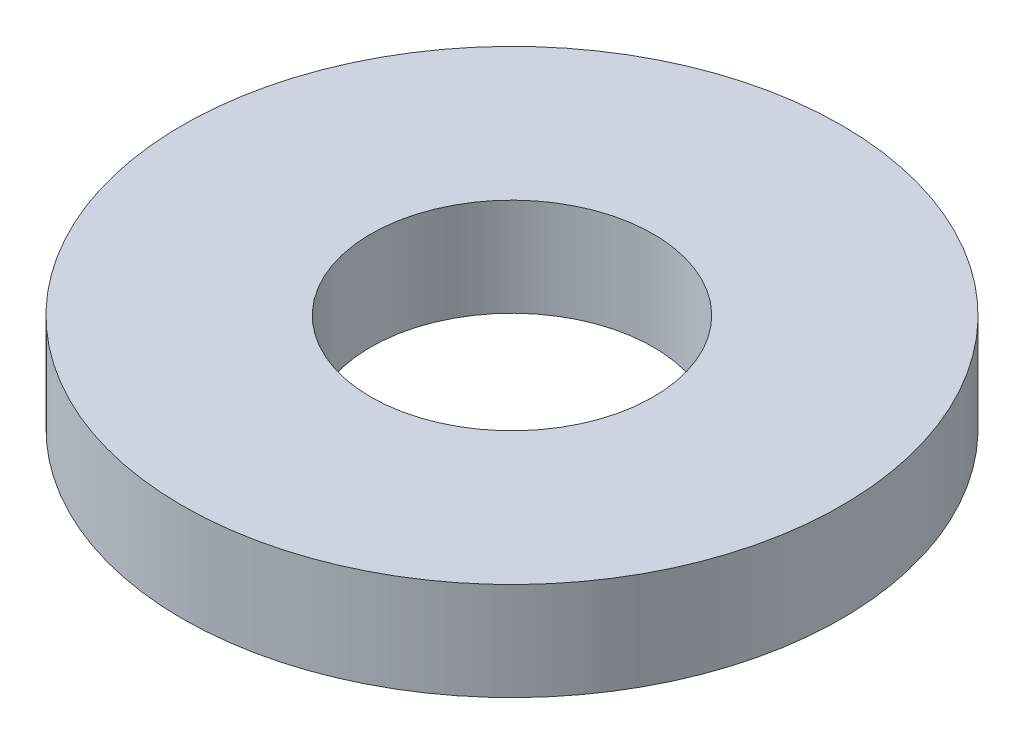
ISO-10303-21;
HEADER;
FILE_DESCRIPTION(('STEP AP214'),'2;1');
FILE_NAME('part.step','',(''),(''),'','','');
FILE_SCHEMA(('AUTOMOTIVE_DESIGN { 1 0 10303 214 1 1 1 1 }'));
ENDSEC;
DATA;
#1=APPLICATION_CONTEXT('core data for automotive mechanical design processes');
#2=APPLICATION_PROTOCOL_DEFINITION('international standard','automotive_design',2000,#1);
#3=PRODUCT_CONTEXT('',#1,'mechanical');
#4=PRODUCT('Part','Part','',(#3));
#5=PRODUCT_RELATED_PRODUCT_CATEGORY('part','',(#4));
#6=PRODUCT_DEFINITION_FORMATION('','',#4);
#7=PRODUCT_DEFINITION_CONTEXT('part definition',#1,'design');
#8=PRODUCT_DEFINITION('design','',#6,#7);
#9=PRODUCT_DEFINITION_SHAPE('','',#8);
#10=(LENGTH_UNIT() NAMED_UNIT(*) SI_UNIT(.MILLI.,.METRE.));
#11=(NAMED_UNIT(*) PLANE_ANGLE_UNIT() SI_UNIT($,.RADIAN.));
#12=(NAMED_UNIT(*) SI_UNIT($,.STERADIAN.) SOLID_ANGLE_UNIT());
#13=UNCERTAINTY_MEASURE_WITH_UNIT(LENGTH_MEASURE(1.E-05),#10,'distance_accuracy_value','');
#14=(GEOMETRIC_REPRESENTATION_CONTEXT(3) GLOBAL_UNCERTAINTY_ASSIGNED_CONTEXT((#13)) GLOBAL_UNIT_ASSIGNED_CONTEXT((#10,
#11,#12)) REPRESENTATION_CONTEXT('',''));
#15=CARTESIAN_POINT('',(0.,0.,0.));
#16=DIRECTION('',(0.,0.,1.));
#17=DIRECTION('',(1.,0.,0.));
#18=AXIS2_PLACEMENT_3D('',#15,#16,#17);
#19=CARTESIAN_POINT('',(3.5527136788005E-12,1.65099999999896,-9.99200722162641E-13));
#20=DIRECTION('',(0.,-0.99999999999999,0.));
#21=DIRECTION('',(0.,0.,-1.00000000000003));
#22=AXIS2_PLACEMENT_3D('',#19,#20,#21);
#23=CYLINDRICAL_SURFACE('',#22,5.55625);
#24=CARTESIAN_POINT('',(3.5527136788005E-12,1.65099999999896,-9.99200722162641E-13));
#25=DIRECTION('',(0.,0.99999999999999,0.));
#26=DIRECTION('',(0.,0.,1.00000000000003));
#27=AXIS2_PLACEMENT_3D('',#24,#25,#26);
#28=CIRCLE('',#27,5.55625);
#29=CARTESIAN_POINT('',(3.62211129145695E-12,1.65099999999894,5.55624999999915));
#30=VERTEX_POINT('',#29);
#31=EDGE_CURVE('E10',#30,#30,#28,.T.);
#32=ORIENTED_EDGE('',*,*,#31,.F.);
#33=EDGE_LOOP('',(#32));
#34=FACE_BOUND('',#33,.T.);
#35=CARTESIAN_POINT('',(0.,0.,0.));
#36=DIRECTION('',(0.,0.99999999999999,0.));
#37=DIRECTION('',(0.,0.,1.00000000000003));
#38=AXIS2_PLACEMENT_3D('',#35,#36,#37);
#39=CIRCLE('',#38,5.55625);
#40=CARTESIAN_POINT('',(0.,0.,5.55625000000015));
#41=VERTEX_POINT('',#40);
#42=EDGE_CURVE('E37',#41,#41,#39,.T.);
#43=ORIENTED_EDGE('',*,*,#42,.T.);
#44=EDGE_LOOP('',(#43));
#45=FACE_BOUND('',#44,.T.);
#46=ADVANCED_FACE('F34',(#34,#45),#23,.T.);
#47=CARTESIAN_POINT('',(3.5527136788005E-12,1.65099999999896,-9.99200722162641E-13));
#48=DIRECTION('',(0.,0.99999999999999,0.));
#49=DIRECTION('',(0.,0.,1.00000000000003));
#50=AXIS2_PLACEMENT_3D('',#47,#48,#49);
#51=PLANE('',#50);
#52=CARTESIAN_POINT('',(3.5527136788005E-12,1.65099999999896,-9.99200722162641E-13));
#53=DIRECTION('',(0.,0.99999999999999,0.));
#54=DIRECTION('',(0.,0.,1.00000000000003));
#55=AXIS2_PLACEMENT_3D('',#52,#53,#54);
#56=CIRCLE('',#55,2.38125);
#57=CARTESIAN_POINT('',(3.58245551279612E-12,1.65099999999895,2.38124999999907));
#58=VERTEX_POINT('',#57);
#59=EDGE_CURVE('E46',#58,#58,#56,.T.);
#60=ORIENTED_EDGE('',*,*,#59,.F.);
#61=EDGE_LOOP('',(#60));
#62=FACE_BOUND('',#61,.T.);
#63=ORIENTED_EDGE('',*,*,#31,.T.);
#64=EDGE_LOOP('',(#63));
#65=FACE_BOUND('',#64,.T.);
#66=ADVANCED_FACE('F61',(#62,#65),#51,.T.);
#67=CARTESIAN_POINT('',(0.,0.,0.));
#68=DIRECTION('',(0.,0.99999999999999,0.));
#69=DIRECTION('',(0.,0.,1.00000000000003));
#70=AXIS2_PLACEMENT_3D('',#67,#68,#69);
#71=PLANE('',#70);
#72=CARTESIAN_POINT('',(0.,0.,0.));
#73=DIRECTION('',(0.,0.99999999999999,0.));
#74=DIRECTION('',(0.,0.,1.00000000000003));
#75=AXIS2_PLACEMENT_3D('',#72,#73,#74);
#76=CIRCLE('',#75,2.38125);
#77=CARTESIAN_POINT('',(0.,0.,2.38125000000006));
#78=VERTEX_POINT('',#77);
#79=EDGE_CURVE('E44',#78,#78,#76,.T.);
#80=ORIENTED_EDGE('',*,*,#79,.T.);
#81=EDGE_LOOP('',(#80));
#82=FACE_BOUND('',#81,.T.);
#83=ORIENTED_EDGE('',*,*,#42,.F.);
#84=EDGE_LOOP('',(#83));
#85=FACE_BOUND('',#84,.T.);
#86=ADVANCED_FACE('F52',(#82,#85),#71,.F.);
#87=CARTESIAN_POINT('',(0.,0.,0.));
#88=DIRECTION('',(0.,0.99999999999999,0.));
#89=DIRECTION('',(0.,0.,1.00000000000003));
#90=AXIS2_PLACEMENT_3D('',#87,#88,#89);
#91=CYLINDRICAL_SURFACE('',#90,2.38125);
#92=ORIENTED_EDGE('',*,*,#79,.F.);
#93=EDGE_LOOP('',(#92));
#94=FACE_BOUND('',#93,.T.);
#95=ORIENTED_EDGE('',*,*,#59,.T.);
#96=EDGE_LOOP('',(#95));
#97=FACE_BOUND('',#96,.T.);
#98=ADVANCED_FACE('F55',(#94,#97),#91,.F.);
#99=CLOSED_SHELL('',(#46,#66,#86,#98));
#100=MANIFOLD_SOLID_BREP('B2',#99);
#101=ADVANCED_BREP_SHAPE_REPRESENTATION('',(#18,#100),#14);
#102=SHAPE_DEFINITION_REPRESENTATION(#9,#101);
ENDSEC;
END-ISO-10303-21;
